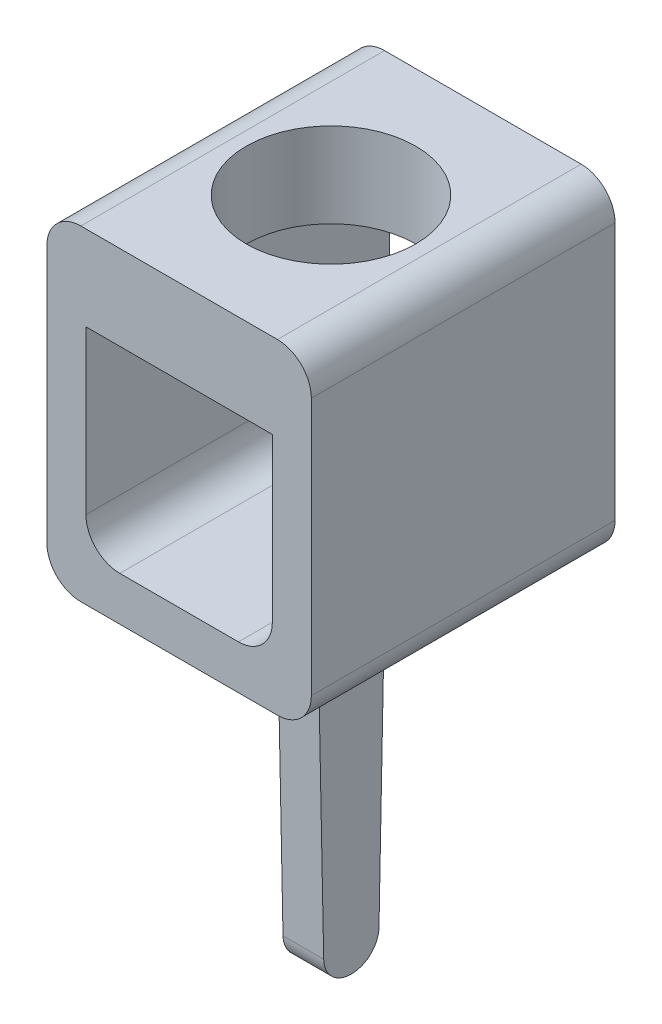
ISO-10303-21;
HEADER;
FILE_DESCRIPTION(('STEP AP214'),'2;1');
FILE_NAME('part.step','',(''),(''),'','','');
FILE_SCHEMA(('AUTOMOTIVE_DESIGN { 1 0 10303 214 1 1 1 1 }'));
ENDSEC;
DATA;
#1=APPLICATION_CONTEXT('core data for automotive mechanical design processes');
#2=APPLICATION_PROTOCOL_DEFINITION('international standard','automotive_design',2000,#1);
#3=PRODUCT_CONTEXT('',#1,'mechanical');
#4=PRODUCT('Part','Part','',(#3));
#5=PRODUCT_RELATED_PRODUCT_CATEGORY('part','',(#4));
#6=PRODUCT_DEFINITION_FORMATION('','',#4);
#7=PRODUCT_DEFINITION_CONTEXT('part definition',#1,'design');
#8=PRODUCT_DEFINITION('design','',#6,#7);
#9=PRODUCT_DEFINITION_SHAPE('','',#8);
#10=(LENGTH_UNIT() NAMED_UNIT(*) SI_UNIT(.MILLI.,.METRE.));
#11=(NAMED_UNIT(*) PLANE_ANGLE_UNIT() SI_UNIT($,.RADIAN.));
#12=(NAMED_UNIT(*) SI_UNIT($,.STERADIAN.) SOLID_ANGLE_UNIT());
#13=UNCERTAINTY_MEASURE_WITH_UNIT(LENGTH_MEASURE(1.E-05),#10,'distance_accuracy_value','');
#14=(GEOMETRIC_REPRESENTATION_CONTEXT(3) GLOBAL_UNCERTAINTY_ASSIGNED_CONTEXT((#13)) GLOBAL_UNIT_ASSIGNED_CONTEXT((#10,
#11,#12)) REPRESENTATION_CONTEXT('',''));
#15=CARTESIAN_POINT('',(0.,0.,0.));
#16=DIRECTION('',(0.,0.,1.));
#17=DIRECTION('',(1.,0.,0.));
#18=AXIS2_PLACEMENT_3D('',#15,#16,#17);
#19=CARTESIAN_POINT('',(0.,-5.,0.));
#20=DIRECTION('',(0.,1.,0.));
#21=DIRECTION('',(-1.,0.,0.));
#22=AXIS2_PLACEMENT_3D('',#19,#20,#21);
#23=PLANE('',#22);
#24=DIRECTION('',(1.,0.,0.));
#25=VECTOR('',#24,1.);
#26=CARTESIAN_POINT('',(0.,-5.,2.2320799920016));
#27=LINE('',#26,#25);
#28=CARTESIAN_POINT('',(2.25,-5.,2.2320799920016));
#29=VERTEX_POINT('',#28);
#30=CARTESIAN_POINT('',(1.65,-5.,2.2320799920016));
#31=VERTEX_POINT('',#30);
#32=EDGE_CURVE('E160',#29,#31,#27,.F.);
#33=ORIENTED_EDGE('',*,*,#32,.F.);
#34=DIRECTION('',(0.,0.,1.));
#35=VECTOR('',#34,1.);
#36=CARTESIAN_POINT('',(2.25,-5.,1.74));
#37=LINE('',#36,#35);
#38=CARTESIAN_POINT('',(2.25,-5.,2.2479200079984));
#39=VERTEX_POINT('',#38);
#40=EDGE_CURVE('E199',#29,#39,#37,.T.);
#41=ORIENTED_EDGE('',*,*,#40,.T.);
#42=DIRECTION('',(-1.,0.,0.));
#43=VECTOR('',#42,1.);
#44=CARTESIAN_POINT('',(0.,-5.,2.2479200079984));
#45=LINE('',#44,#43);
#46=CARTESIAN_POINT('',(1.65,-5.,2.2479200079984));
#47=VERTEX_POINT('',#46);
#48=EDGE_CURVE('E206',#47,#39,#45,.F.);
#49=ORIENTED_EDGE('',*,*,#48,.F.);
#50=DIRECTION('',(0.,0.,1.));
#51=VECTOR('',#50,1.);
#52=CARTESIAN_POINT('',(1.65,-5.,1.74));
#53=LINE('',#52,#51);
#54=EDGE_CURVE('E190',#47,#31,#53,.F.);
#55=ORIENTED_EDGE('',*,*,#54,.T.);
#56=EDGE_LOOP('',(#33,#41,#49,#55));
#57=FACE_BOUND('',#56,.T.);
#58=ADVANCED_FACE('F16',(#57),#23,.F.);
#59=CARTESIAN_POINT('',(0.,-4.6,2.2320799920016));
#60=DIRECTION('',(1.,0.,0.));
#61=DIRECTION('',(0.,1.,0.));
#62=AXIS2_PLACEMENT_3D('',#59,#60,#61);
#63=CYLINDRICAL_SURFACE('',#62,0.4);
#64=CARTESIAN_POINT('',(2.25,-4.6,2.2320799920016));
#65=DIRECTION('',(1.,0.,0.));
#66=DIRECTION('',(0.,1.,0.));
#67=AXIS2_PLACEMENT_3D('',#64,#65,#66);
#68=CIRCLE('',#67,0.4);
#69=CARTESIAN_POINT('',(2.25,-4.60799840047984,1.8321599680096));
#70=VERTEX_POINT('',#69);
#71=EDGE_CURVE('E169',#70,#29,#68,.F.);
#72=ORIENTED_EDGE('',*,*,#71,.T.);
#73=ORIENTED_EDGE('',*,*,#32,.T.);
#74=CARTESIAN_POINT('',(1.65,-4.6,2.2320799920016));
#75=DIRECTION('',(1.,0.,0.));
#76=DIRECTION('',(0.,1.,0.));
#77=AXIS2_PLACEMENT_3D('',#74,#75,#76);
#78=CIRCLE('',#77,0.4);
#79=CARTESIAN_POINT('',(1.65,-4.60799840047984,1.8321599680096));
#80=VERTEX_POINT('',#79);
#81=EDGE_CURVE('E189',#31,#80,#78,.T.);
#82=ORIENTED_EDGE('',*,*,#81,.T.);
#83=DIRECTION('',(1.,0.,0.));
#84=VECTOR('',#83,1.);
#85=CARTESIAN_POINT('',(0.,-4.60799840047984,1.8321599680096));
#86=LINE('',#85,#84);
#87=EDGE_CURVE('E170',#80,#70,#86,.T.);
#88=ORIENTED_EDGE('',*,*,#87,.T.);
#89=EDGE_LOOP('',(#72,#73,#82,#88));
#90=FACE_BOUND('',#89,.T.);
#91=ADVANCED_FACE('F493',(#90),#63,.T.);
#92=CARTESIAN_POINT('',(0.,-5.,1.84));
#93=DIRECTION('',(0.,0.0199960011995966,0.999800059980007));
#94=DIRECTION('',(0.,-0.999800059980007,0.0199960011995966));
#95=AXIS2_PLACEMENT_3D('',#92,#93,#94);
#96=PLANE('',#95);
#97=ORIENTED_EDGE('',*,*,#87,.F.);
#98=DIRECTION('',(0.,0.999800059980007,-0.0199960011995962));
#99=VECTOR('',#98,1.);
#100=CARTESIAN_POINT('',(1.65,-4.60799840047984,1.8321599680096));
#101=LINE('',#100,#99);
#102=CARTESIAN_POINT('',(1.65,-0.3,1.74600000000002));
#103=VERTEX_POINT('',#102);
#104=EDGE_CURVE('E181',#80,#103,#101,.T.);
#105=ORIENTED_EDGE('',*,*,#104,.T.);
#106=CARTESIAN_POINT('',(1.35,-0.3,1.74600000000002));
#107=DIRECTION('',(0.,0.0199960011995966,0.999800059980007));
#108=DIRECTION('',(0.,-0.999800059980007,0.0199960011995966));
#109=AXIS2_PLACEMENT_3D('',#106,#107,#108);
#110=ELLIPSE('',#109,0.3000599940012,0.3);
#111=CARTESIAN_POINT('',(1.35,0.,1.74000000000002));
#112=VERTEX_POINT('',#111);
#113=EDGE_CURVE('E203',#112,#103,#110,.F.);
#114=ORIENTED_EDGE('',*,*,#113,.F.);
#115=DIRECTION('',(1.,0.,0.));
#116=VECTOR('',#115,1.);
#117=CARTESIAN_POINT('',(0.,0.,1.74000000000002));
#118=LINE('',#117,#116);
#119=CARTESIAN_POINT('',(2.55,0.,1.74000000000002));
#120=VERTEX_POINT('',#119);
#121=EDGE_CURVE('E155',#120,#112,#118,.F.);
#122=ORIENTED_EDGE('',*,*,#121,.F.);
#123=CARTESIAN_POINT('',(2.55,-0.3,1.74600000000002));
#124=DIRECTION('',(0.,0.0199960011995966,0.999800059980007));
#125=DIRECTION('',(0.,0.999800059980007,-0.0199960011995966));
#126=AXIS2_PLACEMENT_3D('',#123,#124,#125);
#127=ELLIPSE('',#126,0.3000599940012,0.3);
#128=CARTESIAN_POINT('',(2.25,-0.3,1.74600000000002));
#129=VERTEX_POINT('',#128);
#130=EDGE_CURVE('E19',#129,#120,#127,.F.);
#131=ORIENTED_EDGE('',*,*,#130,.F.);
#132=DIRECTION('',(0.,-0.999800059980007,0.0199960011995962));
#133=VECTOR('',#132,1.);
#134=CARTESIAN_POINT('',(2.25,-0.3,1.74600000000002));
#135=LINE('',#134,#133);
#136=EDGE_CURVE('E153',#129,#70,#135,.T.);
#137=ORIENTED_EDGE('',*,*,#136,.T.);
#138=EDGE_LOOP('',(#97,#105,#114,#122,#131,#137));
#139=FACE_BOUND('',#138,.T.);
#140=ADVANCED_FACE('F152',(#139),#96,.F.);
#141=CARTESIAN_POINT('',(2.25,-5.,1.74));
#142=DIRECTION('',(-1.,0.,0.));
#143=DIRECTION('',(0.,-1.,0.));
#144=AXIS2_PLACEMENT_3D('',#141,#142,#143);
#145=PLANE('',#144);
#146=ORIENTED_EDGE('',*,*,#71,.F.);
#147=ORIENTED_EDGE('',*,*,#136,.F.);
#148=DIRECTION('',(0.,0.,-1.));
#149=VECTOR('',#148,1.);
#150=CARTESIAN_POINT('',(2.25,-0.3,1.74));
#151=LINE('',#150,#149);
#152=CARTESIAN_POINT('',(2.25,-0.3,2.73399999999998));
#153=VERTEX_POINT('',#152);
#154=EDGE_CURVE('E165',#129,#153,#151,.F.);
#155=ORIENTED_EDGE('',*,*,#154,.T.);
#156=DIRECTION('',(0.,0.999800059980007,0.0199960011995966));
#157=VECTOR('',#156,1.);
#158=CARTESIAN_POINT('',(2.25,-5.,2.64));
#159=LINE('',#158,#157);
#160=CARTESIAN_POINT('',(2.25,-4.60799840047984,2.6478400319904));
#161=VERTEX_POINT('',#160);
#162=EDGE_CURVE('E198',#153,#161,#159,.F.);
#163=ORIENTED_EDGE('',*,*,#162,.T.);
#164=CARTESIAN_POINT('',(2.25,-4.6,2.2479200079984));
#165=DIRECTION('',(-1.,0.,0.));
#166=DIRECTION('',(0.,-1.,0.));
#167=AXIS2_PLACEMENT_3D('',#164,#165,#166);
#168=CIRCLE('',#167,0.4);
#169=EDGE_CURVE('E200',#39,#161,#168,.T.);
#170=ORIENTED_EDGE('',*,*,#169,.F.);
#171=ORIENTED_EDGE('',*,*,#40,.F.);
#172=EDGE_LOOP('',(#146,#147,#155,#163,#170,#171));
#173=FACE_BOUND('',#172,.T.);
#174=ADVANCED_FACE('F163',(#173),#145,.F.);
#175=CARTESIAN_POINT('',(0.,-4.6,2.2479200079984));
#176=DIRECTION('',(-1.,0.,0.));
#177=DIRECTION('',(0.,-1.,0.));
#178=AXIS2_PLACEMENT_3D('',#175,#176,#177);
#179=CYLINDRICAL_SURFACE('',#178,0.4);
#180=CARTESIAN_POINT('',(1.65,-4.6,2.2479200079984));
#181=DIRECTION('',(-1.,0.,0.));
#182=DIRECTION('',(0.,-1.,0.));
#183=AXIS2_PLACEMENT_3D('',#180,#181,#182);
#184=CIRCLE('',#183,0.4);
#185=CARTESIAN_POINT('',(1.65,-4.60799840047984,2.6478400319904));
#186=VERTEX_POINT('',#185);
#187=EDGE_CURVE('E193',#186,#47,#184,.F.);
#188=ORIENTED_EDGE('',*,*,#187,.T.);
#189=ORIENTED_EDGE('',*,*,#48,.T.);
#190=ORIENTED_EDGE('',*,*,#169,.T.);
#191=DIRECTION('',(1.,0.,0.));
#192=VECTOR('',#191,1.);
#193=CARTESIAN_POINT('',(0.,-4.60799840047984,2.6478400319904));
#194=LINE('',#193,#192);
#195=EDGE_CURVE('E194',#161,#186,#194,.F.);
#196=ORIENTED_EDGE('',*,*,#195,.T.);
#197=EDGE_LOOP('',(#188,#189,#190,#196));
#198=FACE_BOUND('',#197,.T.);
#199=ADVANCED_FACE('F486',(#198),#179,.T.);
#200=CARTESIAN_POINT('',(1.65,-5.,1.74));
#201=DIRECTION('',(1.,0.,0.));
#202=DIRECTION('',(0.,1.,0.));
#203=AXIS2_PLACEMENT_3D('',#200,#201,#202);
#204=PLANE('',#203);
#205=ORIENTED_EDGE('',*,*,#81,.F.);
#206=ORIENTED_EDGE('',*,*,#54,.F.);
#207=ORIENTED_EDGE('',*,*,#187,.F.);
#208=DIRECTION('',(0.,0.999800059980007,0.0199960011995966));
#209=VECTOR('',#208,1.);
#210=CARTESIAN_POINT('',(1.65,-5.,2.64));
#211=LINE('',#210,#209);
#212=CARTESIAN_POINT('',(1.65,-0.3,2.73399999999998));
#213=VERTEX_POINT('',#212);
#214=EDGE_CURVE('E197',#186,#213,#211,.T.);
#215=ORIENTED_EDGE('',*,*,#214,.T.);
#216=DIRECTION('',(0.,0.,1.));
#217=VECTOR('',#216,1.);
#218=CARTESIAN_POINT('',(1.65,-0.3,1.74));
#219=LINE('',#218,#217);
#220=EDGE_CURVE('E176',#213,#103,#219,.F.);
#221=ORIENTED_EDGE('',*,*,#220,.T.);
#222=ORIENTED_EDGE('',*,*,#104,.F.);
#223=EDGE_LOOP('',(#205,#206,#207,#215,#221,#222));
#224=FACE_BOUND('',#223,.T.);
#225=ADVANCED_FACE('F263',(#224),#204,.F.);
#226=CARTESIAN_POINT('',(1.35,-0.3,1.74));
#227=DIRECTION('',(0.,0.,1.));
#228=DIRECTION('',(1.,0.,0.));
#229=AXIS2_PLACEMENT_3D('',#226,#227,#228);
#230=CYLINDRICAL_SURFACE('',#229,0.3);
#231=ORIENTED_EDGE('',*,*,#113,.T.);
#232=ORIENTED_EDGE('',*,*,#220,.F.);
#233=CARTESIAN_POINT('',(1.35,-0.3,2.73399999999998));
#234=DIRECTION('',(0.,0.0199960011995966,-0.999800059980007));
#235=DIRECTION('',(0.,0.999800059980007,0.0199960011995966));
#236=AXIS2_PLACEMENT_3D('',#233,#234,#235);
#237=ELLIPSE('',#236,0.3000599940012,0.3);
#238=CARTESIAN_POINT('',(1.35,0.,2.73999999999999));
#239=VERTEX_POINT('',#238);
#240=EDGE_CURVE('E175',#213,#239,#237,.F.);
#241=ORIENTED_EDGE('',*,*,#240,.T.);
#242=DIRECTION('',(0.,0.,1.));
#243=VECTOR('',#242,1.);
#244=CARTESIAN_POINT('',(1.35,0.,4.48));
#245=LINE('',#244,#243);
#246=EDGE_CURVE('E184',#239,#112,#245,.F.);
#247=ORIENTED_EDGE('',*,*,#246,.T.);
#248=EDGE_LOOP('',(#231,#232,#241,#247));
#249=FACE_BOUND('',#248,.T.);
#250=ADVANCED_FACE('F257',(#249),#230,.F.);
#251=CARTESIAN_POINT('',(2.55,-0.3,1.74));
#252=DIRECTION('',(0.,0.,-1.));
#253=DIRECTION('',(-1.,0.,0.));
#254=AXIS2_PLACEMENT_3D('',#251,#252,#253);
#255=CYLINDRICAL_SURFACE('',#254,0.3);
#256=ORIENTED_EDGE('',*,*,#130,.T.);
#257=DIRECTION('',(0.,0.,1.));
#258=VECTOR('',#257,1.);
#259=CARTESIAN_POINT('',(2.55,0.,4.48));
#260=LINE('',#259,#258);
#261=CARTESIAN_POINT('',(2.55,0.,2.73999999999999));
#262=VERTEX_POINT('',#261);
#263=EDGE_CURVE('E274',#120,#262,#260,.T.);
#264=ORIENTED_EDGE('',*,*,#263,.T.);
#265=CARTESIAN_POINT('',(2.55,-0.3,2.73399999999998));
#266=DIRECTION('',(0.,0.0199960011995966,-0.999800059980007));
#267=DIRECTION('',(0.,-0.999800059980007,-0.0199960011995966));
#268=AXIS2_PLACEMENT_3D('',#265,#266,#267);
#269=ELLIPSE('',#268,0.3000599940012,0.3);
#270=EDGE_CURVE('E174',#262,#153,#269,.F.);
#271=ORIENTED_EDGE('',*,*,#270,.T.);
#272=ORIENTED_EDGE('',*,*,#154,.F.);
#273=EDGE_LOOP('',(#256,#264,#271,#272));
#274=FACE_BOUND('',#273,.T.);
#275=ADVANCED_FACE('F173',(#274),#255,.F.);
#276=CARTESIAN_POINT('',(0.,-5.,2.64));
#277=DIRECTION('',(0.,0.0199960011995966,-0.999800059980007));
#278=DIRECTION('',(0.,0.999800059980007,0.0199960011995966));
#279=AXIS2_PLACEMENT_3D('',#276,#277,#278);
#280=PLANE('',#279);
#281=ORIENTED_EDGE('',*,*,#195,.F.);
#282=ORIENTED_EDGE('',*,*,#162,.F.);
#283=ORIENTED_EDGE('',*,*,#270,.F.);
#284=DIRECTION('',(-1.,0.,0.));
#285=VECTOR('',#284,1.);
#286=CARTESIAN_POINT('',(0.500000000000004,0.,2.74));
#287=LINE('',#286,#285);
#288=EDGE_CURVE('E275',#262,#239,#287,.T.);
#289=ORIENTED_EDGE('',*,*,#288,.T.);
#290=ORIENTED_EDGE('',*,*,#240,.F.);
#291=ORIENTED_EDGE('',*,*,#214,.F.);
#292=EDGE_LOOP('',(#281,#282,#283,#289,#290,#291));
#293=FACE_BOUND('',#292,.T.);
#294=ADVANCED_FACE('F477',(#293),#280,.F.);
#295=CARTESIAN_POINT('',(0.5,0.5,4.48));
#296=DIRECTION('',(0.,0.,-1.));
#297=DIRECTION('',(-1.,0.,0.));
#298=AXIS2_PLACEMENT_3D('',#295,#296,#297);
#299=CYLINDRICAL_SURFACE('',#298,0.5);
#300=CARTESIAN_POINT('',(0.5,0.5,4.48));
#301=DIRECTION('',(0.,0.,-1.));
#302=DIRECTION('',(-1.,0.,0.));
#303=AXIS2_PLACEMENT_3D('',#300,#301,#302);
#304=CIRCLE('',#303,0.5);
#305=CARTESIAN_POINT('',(0.500000000000002,0.,4.48));
#306=VERTEX_POINT('',#305);
#307=CARTESIAN_POINT('',(0.,0.500000000000002,4.48));
#308=VERTEX_POINT('',#307);
#309=EDGE_CURVE('E245',#306,#308,#304,.T.);
#310=ORIENTED_EDGE('',*,*,#309,.T.);
#311=DIRECTION('',(0.,0.,-1.));
#312=VECTOR('',#311,1.);
#313=CARTESIAN_POINT('',(0.,0.500000000000004,4.48));
#314=LINE('',#313,#312);
#315=CARTESIAN_POINT('',(0.,0.500000000000002,0.));
#316=VERTEX_POINT('',#315);
#317=EDGE_CURVE('E280',#308,#316,#314,.T.);
#318=ORIENTED_EDGE('',*,*,#317,.T.);
#319=CARTESIAN_POINT('',(0.5,0.5,0.));
#320=DIRECTION('',(0.,0.,-1.));
#321=DIRECTION('',(-1.,0.,0.));
#322=AXIS2_PLACEMENT_3D('',#319,#320,#321);
#323=CIRCLE('',#322,0.5);
#324=CARTESIAN_POINT('',(0.500000000000002,0.,0.));
#325=VERTEX_POINT('',#324);
#326=EDGE_CURVE('E247',#316,#325,#323,.F.);
#327=ORIENTED_EDGE('',*,*,#326,.T.);
#328=DIRECTION('',(0.,0.,1.));
#329=VECTOR('',#328,1.);
#330=CARTESIAN_POINT('',(0.500000000000004,0.,4.48));
#331=LINE('',#330,#329);
#332=EDGE_CURVE('E234',#325,#306,#331,.T.);
#333=ORIENTED_EDGE('',*,*,#332,.T.);
#334=EDGE_LOOP('',(#310,#318,#327,#333));
#335=FACE_BOUND('',#334,.T.);
#336=ADVANCED_FACE('F417',(#335),#299,.T.);
#337=CARTESIAN_POINT('',(0.5,4.3,4.48));
#338=DIRECTION('',(0.,0.,-1.));
#339=DIRECTION('',(-1.,0.,0.));
#340=AXIS2_PLACEMENT_3D('',#337,#338,#339);
#341=CYLINDRICAL_SURFACE('',#340,0.5);
#342=CARTESIAN_POINT('',(0.5,4.3,4.48));
#343=DIRECTION('',(0.,0.,-1.));
#344=DIRECTION('',(-1.,0.,0.));
#345=AXIS2_PLACEMENT_3D('',#342,#343,#344);
#346=CIRCLE('',#345,0.5);
#347=CARTESIAN_POINT('',(0.,4.3,4.48));
#348=VERTEX_POINT('',#347);
#349=CARTESIAN_POINT('',(0.500000000000002,4.8,4.48));
#350=VERTEX_POINT('',#349);
#351=EDGE_CURVE('E241',#348,#350,#346,.T.);
#352=ORIENTED_EDGE('',*,*,#351,.T.);
#353=DIRECTION('',(0.,0.,1.));
#354=VECTOR('',#353,1.);
#355=CARTESIAN_POINT('',(0.500000000000003,4.8,4.48));
#356=LINE('',#355,#354);
#357=CARTESIAN_POINT('',(0.500000000000002,4.8,0.));
#358=VERTEX_POINT('',#357);
#359=EDGE_CURVE('E231',#350,#358,#356,.F.);
#360=ORIENTED_EDGE('',*,*,#359,.T.);
#361=CARTESIAN_POINT('',(0.5,4.3,0.));
#362=DIRECTION('',(0.,0.,-1.));
#363=DIRECTION('',(-1.,0.,0.));
#364=AXIS2_PLACEMENT_3D('',#361,#362,#363);
#365=CIRCLE('',#364,0.5);
#366=CARTESIAN_POINT('',(0.,4.3,0.));
#367=VERTEX_POINT('',#366);
#368=EDGE_CURVE('E243',#358,#367,#365,.F.);
#369=ORIENTED_EDGE('',*,*,#368,.T.);
#370=DIRECTION('',(0.,0.,-1.));
#371=VECTOR('',#370,1.);
#372=CARTESIAN_POINT('',(0.,4.3,4.48));
#373=LINE('',#372,#371);
#374=EDGE_CURVE('E277',#367,#348,#373,.F.);
#375=ORIENTED_EDGE('',*,*,#374,.T.);
#376=EDGE_LOOP('',(#352,#360,#369,#375));
#377=FACE_BOUND('',#376,.T.);
#378=ADVANCED_FACE('F345',(#377),#341,.T.);
#379=CARTESIAN_POINT('',(1.95,3.32,2.24));
#380=DIRECTION('',(0.,1.,0.));
#381=DIRECTION('',(-1.,0.,0.));
#382=AXIS2_PLACEMENT_3D('',#379,#380,#381);
#383=CYLINDRICAL_SURFACE('',#382,1.25);
#384=CARTESIAN_POINT('',(1.95,4.8,2.24));
#385=DIRECTION('',(0.,1.,0.));
#386=DIRECTION('',(-1.,0.,0.));
#387=AXIS2_PLACEMENT_3D('',#384,#385,#386);
#388=CIRCLE('',#387,1.25);
#389=CARTESIAN_POINT('',(0.699999999999999,4.8,2.24));
#390=VERTEX_POINT('',#389);
#391=EDGE_CURVE('E227',#390,#390,#388,.T.);
#392=ORIENTED_EDGE('',*,*,#391,.T.);
#393=EDGE_LOOP('',(#392));
#394=FACE_BOUND('',#393,.T.);
#395=CARTESIAN_POINT('',(1.95,3.55,2.24));
#396=DIRECTION('',(0.,1.,0.));
#397=DIRECTION('',(-1.,0.,0.));
#398=AXIS2_PLACEMENT_3D('',#395,#396,#397);
#399=CIRCLE('',#398,1.25);
#400=CARTESIAN_POINT('',(0.7,3.55,2.24));
#401=VERTEX_POINT('',#400);
#402=EDGE_CURVE('E222',#401,#401,#399,.T.);
#403=ORIENTED_EDGE('',*,*,#402,.F.);
#404=EDGE_LOOP('',(#403));
#405=FACE_BOUND('',#404,.T.);
#406=ADVANCED_FACE('F468',(#394,#405),#383,.F.);
#407=CARTESIAN_POINT('',(1.075,1.15,4.48));
#408=DIRECTION('',(0.,0.,-1.));
#409=DIRECTION('',(-1.,0.,0.));
#410=AXIS2_PLACEMENT_3D('',#407,#408,#409);
#411=CYLINDRICAL_SURFACE('',#410,0.5);
#412=DIRECTION('',(0.,0.,-1.));
#413=VECTOR('',#412,1.);
#414=CARTESIAN_POINT('',(0.575,1.15,4.48));
#415=LINE('',#414,#413);
#416=CARTESIAN_POINT('',(0.575,1.15,4.48));
#417=VERTEX_POINT('',#416);
#418=CARTESIAN_POINT('',(0.575,1.15,0.));
#419=VERTEX_POINT('',#418);
#420=EDGE_CURVE('E323',#417,#419,#415,.T.);
#421=ORIENTED_EDGE('',*,*,#420,.F.);
#422=CARTESIAN_POINT('',(1.075,1.15,4.48));
#423=DIRECTION('',(0.,0.,-1.));
#424=DIRECTION('',(-1.,0.,0.));
#425=AXIS2_PLACEMENT_3D('',#422,#423,#424);
#426=CIRCLE('',#425,0.5);
#427=CARTESIAN_POINT('',(1.075,0.65,4.48));
#428=VERTEX_POINT('',#427);
#429=EDGE_CURVE('E239',#428,#417,#426,.T.);
#430=ORIENTED_EDGE('',*,*,#429,.F.);
#431=DIRECTION('',(0.,0.,1.));
#432=VECTOR('',#431,1.);
#433=CARTESIAN_POINT('',(1.075,0.65,4.48));
#434=LINE('',#433,#432);
#435=CARTESIAN_POINT('',(1.075,0.65,0.));
#436=VERTEX_POINT('',#435);
#437=EDGE_CURVE('E320',#436,#428,#434,.T.);
#438=ORIENTED_EDGE('',*,*,#437,.F.);
#439=CARTESIAN_POINT('',(1.075,1.15,0.));
#440=DIRECTION('',(0.,0.,-1.));
#441=DIRECTION('',(-1.,0.,0.));
#442=AXIS2_PLACEMENT_3D('',#439,#440,#441);
#443=CIRCLE('',#442,0.5);
#444=EDGE_CURVE('E237',#419,#436,#443,.F.);
#445=ORIENTED_EDGE('',*,*,#444,.F.);
#446=EDGE_LOOP('',(#421,#430,#438,#445));
#447=FACE_BOUND('',#446,.T.);
#448=ADVANCED_FACE('F465',(#447),#411,.F.);
#449=CARTESIAN_POINT('',(2.825,1.15,4.48));
#450=DIRECTION('',(0.,0.,-1.));
#451=DIRECTION('',(-1.,0.,0.));
#452=AXIS2_PLACEMENT_3D('',#449,#450,#451);
#453=CYLINDRICAL_SURFACE('',#452,0.5);
#454=DIRECTION('',(0.,0.,1.));
#455=VECTOR('',#454,1.);
#456=CARTESIAN_POINT('',(2.825,0.65,4.48));
#457=LINE('',#456,#455);
#458=CARTESIAN_POINT('',(2.825,0.65,4.48));
#459=VERTEX_POINT('',#458);
#460=CARTESIAN_POINT('',(2.825,0.65,0.));
#461=VERTEX_POINT('',#460);
#462=EDGE_CURVE('E293',#459,#461,#457,.F.);
#463=ORIENTED_EDGE('',*,*,#462,.F.);
#464=CARTESIAN_POINT('',(2.825,1.15,4.48));
#465=DIRECTION('',(0.,0.,-1.));
#466=DIRECTION('',(-1.,0.,0.));
#467=AXIS2_PLACEMENT_3D('',#464,#465,#466);
#468=CIRCLE('',#467,0.5);
#469=CARTESIAN_POINT('',(3.325,1.15,4.48));
#470=VERTEX_POINT('',#469);
#471=EDGE_CURVE('E235',#470,#459,#468,.T.);
#472=ORIENTED_EDGE('',*,*,#471,.F.);
#473=DIRECTION('',(0.,0.,1.));
#474=VECTOR('',#473,1.);
#475=CARTESIAN_POINT('',(3.325,1.15,4.48));
#476=LINE('',#475,#474);
#477=CARTESIAN_POINT('',(3.325,1.15,0.));
#478=VERTEX_POINT('',#477);
#479=EDGE_CURVE('E230',#478,#470,#476,.T.);
#480=ORIENTED_EDGE('',*,*,#479,.F.);
#481=CARTESIAN_POINT('',(2.825,1.15,0.));
#482=DIRECTION('',(0.,0.,-1.));
#483=DIRECTION('',(-1.,0.,0.));
#484=AXIS2_PLACEMENT_3D('',#481,#482,#483);
#485=CIRCLE('',#484,0.5);
#486=EDGE_CURVE('E232',#461,#478,#485,.F.);
#487=ORIENTED_EDGE('',*,*,#486,.F.);
#488=EDGE_LOOP('',(#463,#472,#480,#487));
#489=FACE_BOUND('',#488,.T.);
#490=ADVANCED_FACE('F388',(#489),#453,.F.);
#491=CARTESIAN_POINT('',(0.500000000000004,0.,4.48));
#492=DIRECTION('',(0.,1.,0.));
#493=DIRECTION('',(-1.,0.,0.));
#494=AXIS2_PLACEMENT_3D('',#491,#492,#493);
#495=PLANE('',#494);
#496=ORIENTED_EDGE('',*,*,#263,.F.);
#497=ORIENTED_EDGE('',*,*,#121,.T.);
#498=ORIENTED_EDGE('',*,*,#246,.F.);
#499=ORIENTED_EDGE('',*,*,#288,.F.);
#500=EDGE_LOOP('',(#496,#497,#498,#499));
#501=FACE_BOUND('',#500,.T.);
#502=DIRECTION('',(0.,0.,-1.));
#503=VECTOR('',#502,1.);
#504=CARTESIAN_POINT('',(3.4,0.,4.48));
#505=LINE('',#504,#503);
#506=CARTESIAN_POINT('',(3.4,0.,4.48));
#507=VERTEX_POINT('',#506);
#508=CARTESIAN_POINT('',(3.4,0.,0.));
#509=VERTEX_POINT('',#508);
#510=EDGE_CURVE('E221',#507,#509,#505,.T.);
#511=ORIENTED_EDGE('',*,*,#510,.F.);
#512=DIRECTION('',(-1.,0.,0.));
#513=VECTOR('',#512,1.);
#514=CARTESIAN_POINT('',(3.4,0.,4.48));
#515=LINE('',#514,#513);
#516=EDGE_CURVE('E220',#507,#306,#515,.T.);
#517=ORIENTED_EDGE('',*,*,#516,.T.);
#518=ORIENTED_EDGE('',*,*,#332,.F.);
#519=DIRECTION('',(-1.,0.,0.));
#520=VECTOR('',#519,1.);
#521=CARTESIAN_POINT('',(3.4,0.,0.));
#522=LINE('',#521,#520);
#523=EDGE_CURVE('E212',#509,#325,#522,.T.);
#524=ORIENTED_EDGE('',*,*,#523,.F.);
#525=EDGE_LOOP('',(#511,#517,#518,#524));
#526=FACE_BOUND('',#525,.T.);
#527=ADVANCED_FACE('F415',(#501,#526),#495,.F.);
#528=CARTESIAN_POINT('',(0.,0.500000000000004,4.48));
#529=DIRECTION('',(1.,0.,0.));
#530=DIRECTION('',(0.,0.,-1.));
#531=AXIS2_PLACEMENT_3D('',#528,#529,#530);
#532=PLANE('',#531);
#533=ORIENTED_EDGE('',*,*,#317,.F.);
#534=DIRECTION('',(0.,1.,0.));
#535=VECTOR('',#534,1.);
#536=CARTESIAN_POINT('',(0.,4.3,4.48));
#537=LINE('',#536,#535);
#538=EDGE_CURVE('E307',#308,#348,#537,.T.);
#539=ORIENTED_EDGE('',*,*,#538,.T.);
#540=ORIENTED_EDGE('',*,*,#374,.F.);
#541=DIRECTION('',(0.,1.,0.));
#542=VECTOR('',#541,1.);
#543=CARTESIAN_POINT('',(0.,4.3,0.));
#544=LINE('',#543,#542);
#545=EDGE_CURVE('E348',#316,#367,#544,.T.);
#546=ORIENTED_EDGE('',*,*,#545,.F.);
#547=EDGE_LOOP('',(#533,#539,#540,#546));
#548=FACE_BOUND('',#547,.T.);
#549=ADVANCED_FACE('F421',(#548),#532,.F.);
#550=CARTESIAN_POINT('',(0.500000000000003,4.8,4.48));
#551=DIRECTION('',(0.,-1.,0.));
#552=DIRECTION('',(1.,0.,0.));
#553=AXIS2_PLACEMENT_3D('',#550,#551,#552);
#554=PLANE('',#553);
#555=ORIENTED_EDGE('',*,*,#391,.F.);
#556=EDGE_LOOP('',(#555));
#557=FACE_BOUND('',#556,.T.);
#558=ORIENTED_EDGE('',*,*,#359,.F.);
#559=DIRECTION('',(-1.,0.,0.));
#560=VECTOR('',#559,1.);
#561=CARTESIAN_POINT('',(3.4,4.8,4.48));
#562=LINE('',#561,#560);
#563=CARTESIAN_POINT('',(3.4,4.8,4.48));
#564=VERTEX_POINT('',#563);
#565=EDGE_CURVE('E298',#350,#564,#562,.F.);
#566=ORIENTED_EDGE('',*,*,#565,.T.);
#567=DIRECTION('',(0.,0.,-1.));
#568=VECTOR('',#567,1.);
#569=CARTESIAN_POINT('',(3.4,4.8,4.48));
#570=LINE('',#569,#568);
#571=CARTESIAN_POINT('',(3.4,4.8,0.));
#572=VERTEX_POINT('',#571);
#573=EDGE_CURVE('E216',#572,#564,#570,.F.);
#574=ORIENTED_EDGE('',*,*,#573,.F.);
#575=DIRECTION('',(-1.,0.,0.));
#576=VECTOR('',#575,1.);
#577=CARTESIAN_POINT('',(3.4,4.8,0.));
#578=LINE('',#577,#576);
#579=EDGE_CURVE('E346',#358,#572,#578,.F.);
#580=ORIENTED_EDGE('',*,*,#579,.F.);
#581=EDGE_LOOP('',(#558,#566,#574,#580));
#582=FACE_BOUND('',#581,.T.);
#583=ADVANCED_FACE('F347',(#557,#582),#554,.F.);
#584=CARTESIAN_POINT('',(3.325,1.15,4.48));
#585=DIRECTION('',(-1.,0.,0.));
#586=DIRECTION('',(0.,0.,1.));
#587=AXIS2_PLACEMENT_3D('',#584,#585,#586);
#588=PLANE('',#587);
#589=DIRECTION('',(0.,1.,0.));
#590=VECTOR('',#589,1.);
#591=CARTESIAN_POINT('',(3.325,4.3,4.48));
#592=LINE('',#591,#590);
#593=CARTESIAN_POINT('',(3.325,3.55,4.48));
#594=VERTEX_POINT('',#593);
#595=EDGE_CURVE('E294',#470,#594,#592,.T.);
#596=ORIENTED_EDGE('',*,*,#595,.T.);
#597=DIRECTION('',(0.,0.,-1.));
#598=VECTOR('',#597,1.);
#599=CARTESIAN_POINT('',(3.325,3.55,4.48));
#600=LINE('',#599,#598);
#601=CARTESIAN_POINT('',(3.325,3.55,0.));
#602=VERTEX_POINT('',#601);
#603=EDGE_CURVE('E226',#602,#594,#600,.F.);
#604=ORIENTED_EDGE('',*,*,#603,.F.);
#605=DIRECTION('',(0.,1.,0.));
#606=VECTOR('',#605,1.);
#607=CARTESIAN_POINT('',(3.325,4.3,0.));
#608=LINE('',#607,#606);
#609=EDGE_CURVE('E336',#478,#602,#608,.T.);
#610=ORIENTED_EDGE('',*,*,#609,.F.);
#611=ORIENTED_EDGE('',*,*,#479,.T.);
#612=EDGE_LOOP('',(#596,#604,#610,#611));
#613=FACE_BOUND('',#612,.T.);
#614=ADVANCED_FACE('F450',(#613),#588,.T.);
#615=CARTESIAN_POINT('',(0.575,3.55,4.48));
#616=DIRECTION('',(0.,-1.,0.));
#617=DIRECTION('',(0.,0.,-1.));
#618=AXIS2_PLACEMENT_3D('',#615,#616,#617);
#619=PLANE('',#618);
#620=ORIENTED_EDGE('',*,*,#402,.T.);
#621=EDGE_LOOP('',(#620));
#622=FACE_BOUND('',#621,.T.);
#623=DIRECTION('',(-1.,0.,0.));
#624=VECTOR('',#623,1.);
#625=CARTESIAN_POINT('',(3.4,3.55,4.48));
#626=LINE('',#625,#624);
#627=CARTESIAN_POINT('',(0.575,3.55,4.48));
#628=VERTEX_POINT('',#627);
#629=EDGE_CURVE('E295',#594,#628,#626,.T.);
#630=ORIENTED_EDGE('',*,*,#629,.T.);
#631=DIRECTION('',(0.,0.,-1.));
#632=VECTOR('',#631,1.);
#633=CARTESIAN_POINT('',(0.575,3.55,4.48));
#634=LINE('',#633,#632);
#635=CARTESIAN_POINT('',(0.575,3.55,0.));
#636=VERTEX_POINT('',#635);
#637=EDGE_CURVE('E225',#636,#628,#634,.F.);
#638=ORIENTED_EDGE('',*,*,#637,.F.);
#639=DIRECTION('',(-1.,0.,0.));
#640=VECTOR('',#639,1.);
#641=CARTESIAN_POINT('',(3.4,3.55,0.));
#642=LINE('',#641,#640);
#643=EDGE_CURVE('E332',#602,#636,#642,.T.);
#644=ORIENTED_EDGE('',*,*,#643,.F.);
#645=ORIENTED_EDGE('',*,*,#603,.T.);
#646=EDGE_LOOP('',(#630,#638,#644,#645));
#647=FACE_BOUND('',#646,.T.);
#648=ADVANCED_FACE('F447',(#622,#647),#619,.T.);
#649=CARTESIAN_POINT('',(0.575,1.15,4.48));
#650=DIRECTION('',(1.,0.,0.));
#651=DIRECTION('',(0.,0.,-1.));
#652=AXIS2_PLACEMENT_3D('',#649,#650,#651);
#653=PLANE('',#652);
#654=DIRECTION('',(0.,1.,0.));
#655=VECTOR('',#654,1.);
#656=CARTESIAN_POINT('',(0.575,4.3,4.48));
#657=LINE('',#656,#655);
#658=EDGE_CURVE('E297',#628,#417,#657,.F.);
#659=ORIENTED_EDGE('',*,*,#658,.T.);
#660=ORIENTED_EDGE('',*,*,#420,.T.);
#661=DIRECTION('',(0.,1.,0.));
#662=VECTOR('',#661,1.);
#663=CARTESIAN_POINT('',(0.575,4.3,0.));
#664=LINE('',#663,#662);
#665=EDGE_CURVE('E335',#636,#419,#664,.F.);
#666=ORIENTED_EDGE('',*,*,#665,.F.);
#667=ORIENTED_EDGE('',*,*,#637,.T.);
#668=EDGE_LOOP('',(#659,#660,#666,#667));
#669=FACE_BOUND('',#668,.T.);
#670=ADVANCED_FACE('F401',(#669),#653,.T.);
#671=CARTESIAN_POINT('',(1.075,0.65,4.48));
#672=DIRECTION('',(0.,1.,0.));
#673=DIRECTION('',(0.,0.,1.));
#674=AXIS2_PLACEMENT_3D('',#671,#672,#673);
#675=PLANE('',#674);
#676=DIRECTION('',(-1.,0.,0.));
#677=VECTOR('',#676,1.);
#678=CARTESIAN_POINT('',(3.4,0.65,4.48));
#679=LINE('',#678,#677);
#680=EDGE_CURVE('E304',#428,#459,#679,.F.);
#681=ORIENTED_EDGE('',*,*,#680,.T.);
#682=ORIENTED_EDGE('',*,*,#462,.T.);
#683=DIRECTION('',(-1.,0.,0.));
#684=VECTOR('',#683,1.);
#685=CARTESIAN_POINT('',(3.4,0.65,0.));
#686=LINE('',#685,#684);
#687=EDGE_CURVE('E365',#436,#461,#686,.F.);
#688=ORIENTED_EDGE('',*,*,#687,.F.);
#689=ORIENTED_EDGE('',*,*,#437,.T.);
#690=EDGE_LOOP('',(#681,#682,#688,#689));
#691=FACE_BOUND('',#690,.T.);
#692=ADVANCED_FACE('F375',(#691),#675,.T.);
#693=CARTESIAN_POINT('',(3.4,0.5,4.48));
#694=DIRECTION('',(0.,0.,-1.));
#695=DIRECTION('',(-1.,0.,0.));
#696=AXIS2_PLACEMENT_3D('',#693,#694,#695);
#697=CYLINDRICAL_SURFACE('',#696,0.5);
#698=CARTESIAN_POINT('',(3.4,0.5,4.48));
#699=DIRECTION('',(0.,0.,-1.));
#700=DIRECTION('',(-1.,0.,0.));
#701=AXIS2_PLACEMENT_3D('',#698,#699,#700);
#702=CIRCLE('',#701,0.5);
#703=CARTESIAN_POINT('',(3.9,0.5,4.48));
#704=VERTEX_POINT('',#703);
#705=EDGE_CURVE('E217',#704,#507,#702,.T.);
#706=ORIENTED_EDGE('',*,*,#705,.T.);
#707=ORIENTED_EDGE('',*,*,#510,.T.);
#708=CARTESIAN_POINT('',(3.4,0.5,0.));
#709=DIRECTION('',(0.,0.,-1.));
#710=DIRECTION('',(-1.,0.,0.));
#711=AXIS2_PLACEMENT_3D('',#708,#709,#710);
#712=CIRCLE('',#711,0.5);
#713=CARTESIAN_POINT('',(3.9,0.5,0.));
#714=VERTEX_POINT('',#713);
#715=EDGE_CURVE('E209',#714,#509,#712,.T.);
#716=ORIENTED_EDGE('',*,*,#715,.F.);
#717=DIRECTION('',(0.,0.,1.));
#718=VECTOR('',#717,1.);
#719=CARTESIAN_POINT('',(3.9,0.5,4.48));
#720=LINE('',#719,#718);
#721=EDGE_CURVE('E362',#714,#704,#720,.T.);
#722=ORIENTED_EDGE('',*,*,#721,.T.);
#723=EDGE_LOOP('',(#706,#707,#716,#722));
#724=FACE_BOUND('',#723,.T.);
#725=ADVANCED_FACE('F410',(#724),#697,.T.);
#726=CARTESIAN_POINT('',(3.4,4.3,4.48));
#727=DIRECTION('',(0.,0.,-1.));
#728=DIRECTION('',(-1.,0.,0.));
#729=AXIS2_PLACEMENT_3D('',#726,#727,#728);
#730=PLANE('',#729);
#731=ORIENTED_EDGE('',*,*,#471,.T.);
#732=ORIENTED_EDGE('',*,*,#680,.F.);
#733=ORIENTED_EDGE('',*,*,#429,.T.);
#734=ORIENTED_EDGE('',*,*,#658,.F.);
#735=ORIENTED_EDGE('',*,*,#629,.F.);
#736=ORIENTED_EDGE('',*,*,#595,.F.);
#737=EDGE_LOOP('',(#731,#732,#733,#734,#735,#736));
#738=FACE_BOUND('',#737,.T.);
#739=ORIENTED_EDGE('',*,*,#565,.F.);
#740=ORIENTED_EDGE('',*,*,#351,.F.);
#741=ORIENTED_EDGE('',*,*,#538,.F.);
#742=ORIENTED_EDGE('',*,*,#309,.F.);
#743=ORIENTED_EDGE('',*,*,#516,.F.);
#744=ORIENTED_EDGE('',*,*,#705,.F.);
#745=DIRECTION('',(0.,1.,0.));
#746=VECTOR('',#745,1.);
#747=CARTESIAN_POINT('',(3.9,0.500000000000004,4.48));
#748=LINE('',#747,#746);
#749=CARTESIAN_POINT('',(3.9,4.3,4.48));
#750=VERTEX_POINT('',#749);
#751=EDGE_CURVE('E360',#704,#750,#748,.T.);
#752=ORIENTED_EDGE('',*,*,#751,.T.);
#753=CARTESIAN_POINT('',(3.4,4.3,4.48));
#754=DIRECTION('',(0.,0.,-1.));
#755=DIRECTION('',(-1.,0.,0.));
#756=AXIS2_PLACEMENT_3D('',#753,#754,#755);
#757=CIRCLE('',#756,0.5);
#758=EDGE_CURVE('E214',#564,#750,#757,.T.);
#759=ORIENTED_EDGE('',*,*,#758,.F.);
#760=EDGE_LOOP('',(#739,#740,#741,#742,#743,#744,#752,#759));
#761=FACE_BOUND('',#760,.T.);
#762=ADVANCED_FACE('F381',(#738,#761),#730,.F.);
#763=CARTESIAN_POINT('',(3.4,4.3,4.48));
#764=DIRECTION('',(0.,0.,-1.));
#765=DIRECTION('',(-1.,0.,0.));
#766=AXIS2_PLACEMENT_3D('',#763,#764,#765);
#767=CYLINDRICAL_SURFACE('',#766,0.5);
#768=ORIENTED_EDGE('',*,*,#758,.T.);
#769=DIRECTION('',(0.,0.,1.));
#770=VECTOR('',#769,1.);
#771=CARTESIAN_POINT('',(3.9,4.3,4.48));
#772=LINE('',#771,#770);
#773=CARTESIAN_POINT('',(3.9,4.3,0.));
#774=VERTEX_POINT('',#773);
#775=EDGE_CURVE('E25',#750,#774,#772,.F.);
#776=ORIENTED_EDGE('',*,*,#775,.T.);
#777=CARTESIAN_POINT('',(3.4,4.3,0.));
#778=DIRECTION('',(0.,0.,-1.));
#779=DIRECTION('',(-1.,0.,0.));
#780=AXIS2_PLACEMENT_3D('',#777,#778,#779);
#781=CIRCLE('',#780,0.5);
#782=EDGE_CURVE('E33',#572,#774,#781,.T.);
#783=ORIENTED_EDGE('',*,*,#782,.F.);
#784=ORIENTED_EDGE('',*,*,#573,.T.);
#785=EDGE_LOOP('',(#768,#776,#783,#784));
#786=FACE_BOUND('',#785,.T.);
#787=ADVANCED_FACE('F426',(#786),#767,.T.);
#788=CARTESIAN_POINT('',(3.4,4.3,0.));
#789=DIRECTION('',(0.,0.,-1.));
#790=DIRECTION('',(-1.,0.,0.));
#791=AXIS2_PLACEMENT_3D('',#788,#789,#790);
#792=PLANE('',#791);
#793=ORIENTED_EDGE('',*,*,#444,.T.);
#794=ORIENTED_EDGE('',*,*,#687,.T.);
#795=ORIENTED_EDGE('',*,*,#486,.T.);
#796=ORIENTED_EDGE('',*,*,#609,.T.);
#797=ORIENTED_EDGE('',*,*,#643,.T.);
#798=ORIENTED_EDGE('',*,*,#665,.T.);
#799=EDGE_LOOP('',(#793,#794,#795,#796,#797,#798));
#800=FACE_BOUND('',#799,.T.);
#801=ORIENTED_EDGE('',*,*,#368,.F.);
#802=ORIENTED_EDGE('',*,*,#579,.T.);
#803=ORIENTED_EDGE('',*,*,#782,.T.);
#804=DIRECTION('',(0.,1.,0.));
#805=VECTOR('',#804,1.);
#806=CARTESIAN_POINT('',(3.9,0.500000000000004,0.));
#807=LINE('',#806,#805);
#808=EDGE_CURVE('E11',#774,#714,#807,.F.);
#809=ORIENTED_EDGE('',*,*,#808,.T.);
#810=ORIENTED_EDGE('',*,*,#715,.T.);
#811=ORIENTED_EDGE('',*,*,#523,.T.);
#812=ORIENTED_EDGE('',*,*,#326,.F.);
#813=ORIENTED_EDGE('',*,*,#545,.T.);
#814=EDGE_LOOP('',(#801,#802,#803,#809,#810,#811,#812,#813));
#815=FACE_BOUND('',#814,.T.);
#816=ADVANCED_FACE('F391',(#800,#815),#792,.T.);
#817=CARTESIAN_POINT('',(3.9,0.500000000000004,4.48));
#818=DIRECTION('',(-1.,0.,0.));
#819=DIRECTION('',(0.,0.,1.));
#820=AXIS2_PLACEMENT_3D('',#817,#818,#819);
#821=PLANE('',#820);
#822=ORIENTED_EDGE('',*,*,#775,.F.);
#823=ORIENTED_EDGE('',*,*,#751,.F.);
#824=ORIENTED_EDGE('',*,*,#721,.F.);
#825=ORIENTED_EDGE('',*,*,#808,.F.);
#826=EDGE_LOOP('',(#822,#823,#824,#825));
#827=FACE_BOUND('',#826,.T.);
#828=ADVANCED_FACE('F428',(#827),#821,.F.);
#829=CLOSED_SHELL('',(#58,#91,#140,#174,#199,#225,#250,#275,#294,#336,#378,#406,#448,#490,#527,
#549,#583,#614,#648,#670,#692,#725,#762,#787,#816,#828));
#830=MANIFOLD_SOLID_BREP('B1',#829);
#831=ADVANCED_BREP_SHAPE_REPRESENTATION('',(#18,#830),#14);
#832=SHAPE_DEFINITION_REPRESENTATION(#9,#831);
ENDSEC;
END-ISO-10303-21;
